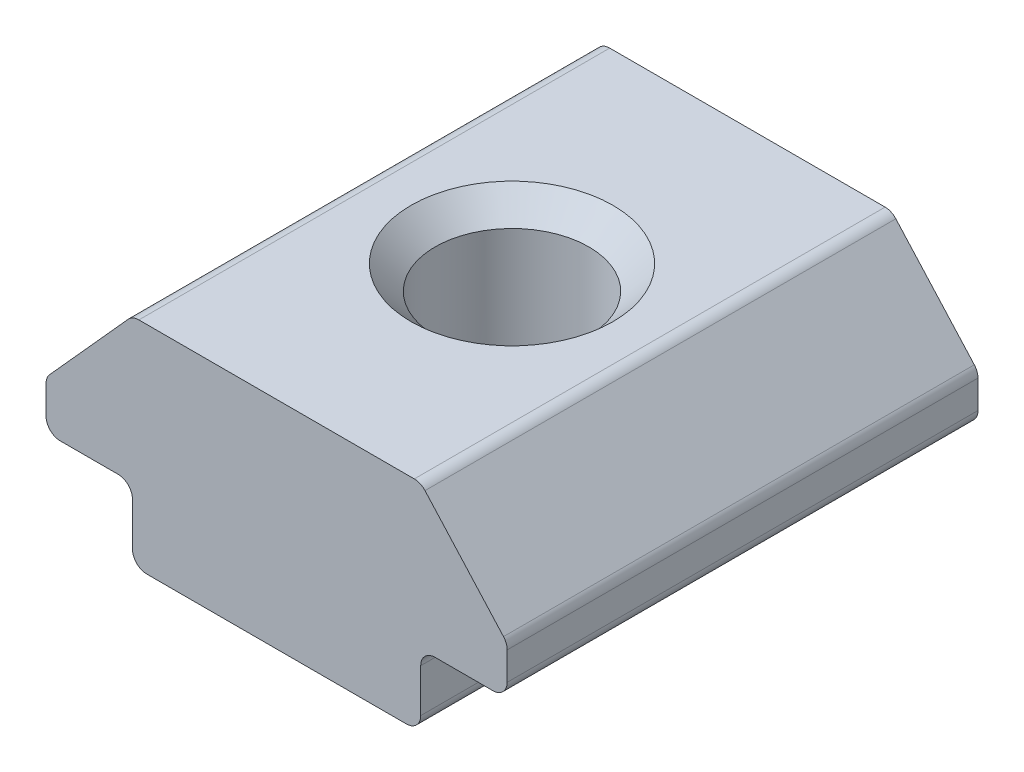
ISO-10303-21;
HEADER;
FILE_DESCRIPTION(('STEP AP214'),'2;1');
FILE_NAME('part.step','',(''),(''),'','','');
FILE_SCHEMA(('AUTOMOTIVE_DESIGN { 1 0 10303 214 1 1 1 1 }'));
ENDSEC;
DATA;
#1=APPLICATION_CONTEXT('core data for automotive mechanical design processes');
#2=APPLICATION_PROTOCOL_DEFINITION('international standard','automotive_design',2000,#1);
#3=PRODUCT_CONTEXT('',#1,'mechanical');
#4=PRODUCT('Part','Part','',(#3));
#5=PRODUCT_RELATED_PRODUCT_CATEGORY('part','',(#4));
#6=PRODUCT_DEFINITION_FORMATION('','',#4);
#7=PRODUCT_DEFINITION_CONTEXT('part definition',#1,'design');
#8=PRODUCT_DEFINITION('design','',#6,#7);
#9=PRODUCT_DEFINITION_SHAPE('','',#8);
#10=(LENGTH_UNIT() NAMED_UNIT(*) SI_UNIT(.MILLI.,.METRE.));
#11=(NAMED_UNIT(*) PLANE_ANGLE_UNIT() SI_UNIT($,.RADIAN.));
#12=(NAMED_UNIT(*) SI_UNIT($,.STERADIAN.) SOLID_ANGLE_UNIT());
#13=UNCERTAINTY_MEASURE_WITH_UNIT(LENGTH_MEASURE(1.E-05),#10,'distance_accuracy_value','');
#14=(GEOMETRIC_REPRESENTATION_CONTEXT(3) GLOBAL_UNCERTAINTY_ASSIGNED_CONTEXT((#13)) GLOBAL_UNIT_ASSIGNED_CONTEXT((#10,
#11,#12)) REPRESENTATION_CONTEXT('',''));
#15=CARTESIAN_POINT('',(0.,0.,0.));
#16=DIRECTION('',(0.,0.,1.));
#17=DIRECTION('',(1.,0.,0.));
#18=AXIS2_PLACEMENT_3D('',#15,#16,#17);
#19=CARTESIAN_POINT('',(-4.56181460766902,2.17462627726309,3.53766362557271));
#20=DIRECTION('',(1.,0.,0.));
#21=DIRECTION('',(0.,0.,-1.));
#22=AXIS2_PLACEMENT_3D('',#19,#20,#21);
#23=PLANE('',#22);
#24=DIRECTION('',(0.,-1.,0.));
#25=VECTOR('',#24,1.);
#26=CARTESIAN_POINT('',(-4.56181460766902,2.17462627726309,-6.26233637442729));
#27=LINE('',#26,#25);
#28=CARTESIAN_POINT('',(-4.56181460766902,1.87462627726309,-6.26233637442729));
#29=VERTEX_POINT('',#28);
#30=CARTESIAN_POINT('',(-4.56181460766902,0.974626277263088,-6.26233637442729));
#31=VERTEX_POINT('',#30);
#32=EDGE_CURVE('E302',#29,#31,#27,.T.);
#33=ORIENTED_EDGE('',*,*,#32,.T.);
#34=DIRECTION('',(0.,0.,-1.));
#35=VECTOR('',#34,1.);
#36=CARTESIAN_POINT('',(-4.56181460766902,0.974626277263088,3.53766362557271));
#37=LINE('',#36,#35);
#38=CARTESIAN_POINT('',(-4.56181460766902,0.974626277263088,3.53766362557271));
#39=VERTEX_POINT('',#38);
#40=EDGE_CURVE('E39',#31,#39,#37,.F.);
#41=ORIENTED_EDGE('',*,*,#40,.T.);
#42=DIRECTION('',(0.,-1.,0.));
#43=VECTOR('',#42,1.);
#44=CARTESIAN_POINT('',(-4.56181460766902,2.17462627726309,3.53766362557271));
#45=LINE('',#44,#43);
#46=CARTESIAN_POINT('',(-4.56181460766902,1.87462627726309,3.53766362557271));
#47=VERTEX_POINT('',#46);
#48=EDGE_CURVE('E183',#47,#39,#45,.T.);
#49=ORIENTED_EDGE('',*,*,#48,.F.);
#50=DIRECTION('',(0.,0.,-1.));
#51=VECTOR('',#50,1.);
#52=CARTESIAN_POINT('',(-4.56181460766902,1.87462627726309,-6.26233637442729));
#53=LINE('',#52,#51);
#54=EDGE_CURVE('E257',#47,#29,#53,.T.);
#55=ORIENTED_EDGE('',*,*,#54,.T.);
#56=EDGE_LOOP('',(#33,#41,#49,#55));
#57=FACE_BOUND('',#56,.T.);
#58=ADVANCED_FACE('F16',(#57),#23,.F.);
#59=CARTESIAN_POINT('',(-4.56181460766902,0.674626277263088,3.53766362557271));
#60=DIRECTION('',(0.,1.,0.));
#61=DIRECTION('',(0.,0.,1.));
#62=AXIS2_PLACEMENT_3D('',#59,#60,#61);
#63=PLANE('',#62);
#64=CARTESIAN_POINT('',(-1.56181460766902,0.674626277263088,-1.36233637442729));
#65=DIRECTION('',(0.,1.,0.));
#66=DIRECTION('',(0.,0.,1.));
#67=AXIS2_PLACEMENT_3D('',#64,#65,#66);
#68=CIRCLE('',#67,2.1);
#69=CARTESIAN_POINT('',(-1.56181460766902,0.674626277263088,0.737663625572716));
#70=VERTEX_POINT('',#69);
#71=EDGE_CURVE('E272',#70,#70,#68,.T.);
#72=ORIENTED_EDGE('',*,*,#71,.T.);
#73=EDGE_LOOP('',(#72));
#74=FACE_BOUND('',#73,.T.);
#75=DIRECTION('',(1.,0.,0.));
#76=VECTOR('',#75,1.);
#77=CARTESIAN_POINT('',(-4.56181460766902,0.674626277263088,-6.26233637442729));
#78=LINE('',#77,#76);
#79=CARTESIAN_POINT('',(-4.26181460766902,0.674626277263088,-6.26233637442729));
#80=VERTEX_POINT('',#79);
#81=CARTESIAN_POINT('',(1.13818539233098,0.674626277263088,-6.26233637442729));
#82=VERTEX_POINT('',#81);
#83=EDGE_CURVE('E296',#80,#82,#78,.T.);
#84=ORIENTED_EDGE('',*,*,#83,.T.);
#85=DIRECTION('',(0.,0.,-1.));
#86=VECTOR('',#85,1.);
#87=CARTESIAN_POINT('',(1.13818539233098,0.674626277263088,3.53766362557271));
#88=LINE('',#87,#86);
#89=CARTESIAN_POINT('',(1.13818539233098,0.674626277263088,3.53766362557271));
#90=VERTEX_POINT('',#89);
#91=EDGE_CURVE('E251',#82,#90,#88,.F.);
#92=ORIENTED_EDGE('',*,*,#91,.T.);
#93=DIRECTION('',(1.,0.,0.));
#94=VECTOR('',#93,1.);
#95=CARTESIAN_POINT('',(-4.56181460766902,0.674626277263088,3.53766362557271));
#96=LINE('',#95,#94);
#97=CARTESIAN_POINT('',(-4.26181460766902,0.674626277263088,3.53766362557271));
#98=VERTEX_POINT('',#97);
#99=EDGE_CURVE('E186',#98,#90,#96,.T.);
#100=ORIENTED_EDGE('',*,*,#99,.F.);
#101=DIRECTION('',(0.,0.,-1.));
#102=VECTOR('',#101,1.);
#103=CARTESIAN_POINT('',(-4.26181460766902,0.674626277263088,3.53766362557271));
#104=LINE('',#103,#102);
#105=EDGE_CURVE('E248',#98,#80,#104,.T.);
#106=ORIENTED_EDGE('',*,*,#105,.T.);
#107=EDGE_LOOP('',(#84,#92,#100,#106));
#108=FACE_BOUND('',#107,.T.);
#109=ADVANCED_FACE('F289',(#74,#108),#63,.F.);
#110=CARTESIAN_POINT('',(1.43818539233098,0.674626277263088,3.53766362557271));
#111=DIRECTION('',(-1.,0.,0.));
#112=DIRECTION('',(0.,0.,1.));
#113=AXIS2_PLACEMENT_3D('',#110,#111,#112);
#114=PLANE('',#113);
#115=DIRECTION('',(0.,1.,0.));
#116=VECTOR('',#115,1.);
#117=CARTESIAN_POINT('',(1.43818539233098,0.674626277263088,3.53766362557271));
#118=LINE('',#117,#116);
#119=CARTESIAN_POINT('',(1.43818539233098,0.974626277263088,3.53766362557271));
#120=VERTEX_POINT('',#119);
#121=CARTESIAN_POINT('',(1.43818539233098,1.87462627726309,3.53766362557271));
#122=VERTEX_POINT('',#121);
#123=EDGE_CURVE('E310',#120,#122,#118,.T.);
#124=ORIENTED_EDGE('',*,*,#123,.F.);
#125=DIRECTION('',(0.,0.,-1.));
#126=VECTOR('',#125,1.);
#127=CARTESIAN_POINT('',(1.43818539233098,0.974626277263088,3.53766362557271));
#128=LINE('',#127,#126);
#129=CARTESIAN_POINT('',(1.43818539233098,0.974626277263088,-6.26233637442729));
#130=VERTEX_POINT('',#129);
#131=EDGE_CURVE('E241',#120,#130,#128,.T.);
#132=ORIENTED_EDGE('',*,*,#131,.T.);
#133=DIRECTION('',(0.,1.,0.));
#134=VECTOR('',#133,1.);
#135=CARTESIAN_POINT('',(1.43818539233098,0.674626277263088,-6.26233637442729));
#136=LINE('',#135,#134);
#137=CARTESIAN_POINT('',(1.43818539233098,1.87462627726309,-6.26233637442729));
#138=VERTEX_POINT('',#137);
#139=EDGE_CURVE('E301',#130,#138,#136,.T.);
#140=ORIENTED_EDGE('',*,*,#139,.T.);
#141=DIRECTION('',(0.,0.,-1.));
#142=VECTOR('',#141,1.);
#143=CARTESIAN_POINT('',(1.43818539233098,1.87462627726309,3.53766362557271));
#144=LINE('',#143,#142);
#145=EDGE_CURVE('E239',#138,#122,#144,.F.);
#146=ORIENTED_EDGE('',*,*,#145,.T.);
#147=EDGE_LOOP('',(#124,#132,#140,#146));
#148=FACE_BOUND('',#147,.T.);
#149=ADVANCED_FACE('F292',(#148),#114,.F.);
#150=CARTESIAN_POINT('',(1.43818539233098,2.17462627726309,3.53766362557271));
#151=DIRECTION('',(0.,1.,0.));
#152=DIRECTION('',(0.,0.,1.));
#153=AXIS2_PLACEMENT_3D('',#150,#151,#152);
#154=PLANE('',#153);
#155=DIRECTION('',(1.,0.,0.));
#156=VECTOR('',#155,1.);
#157=CARTESIAN_POINT('',(1.43818539233098,2.17462627726309,3.53766362557271));
#158=LINE('',#157,#156);
#159=CARTESIAN_POINT('',(1.73818539233098,2.17462627726309,3.53766362557271));
#160=VERTEX_POINT('',#159);
#161=CARTESIAN_POINT('',(2.93818539233098,2.17462627726309,3.53766362557271));
#162=VERTEX_POINT('',#161);
#163=EDGE_CURVE('E314',#160,#162,#158,.T.);
#164=ORIENTED_EDGE('',*,*,#163,.F.);
#165=DIRECTION('',(0.,0.,-1.));
#166=VECTOR('',#165,1.);
#167=CARTESIAN_POINT('',(1.73818539233098,2.17462627726309,-6.26233637442729));
#168=LINE('',#167,#166);
#169=CARTESIAN_POINT('',(1.73818539233098,2.17462627726309,-6.26233637442729));
#170=VERTEX_POINT('',#169);
#171=EDGE_CURVE('E261',#160,#170,#168,.T.);
#172=ORIENTED_EDGE('',*,*,#171,.T.);
#173=DIRECTION('',(1.,0.,0.));
#174=VECTOR('',#173,1.);
#175=CARTESIAN_POINT('',(1.43818539233098,2.17462627726309,-6.26233637442729));
#176=LINE('',#175,#174);
#177=CARTESIAN_POINT('',(2.93818539233098,2.17462627726309,-6.26233637442729));
#178=VERTEX_POINT('',#177);
#179=EDGE_CURVE('E337',#170,#178,#176,.T.);
#180=ORIENTED_EDGE('',*,*,#179,.T.);
#181=DIRECTION('',(0.,0.,-1.));
#182=VECTOR('',#181,1.);
#183=CARTESIAN_POINT('',(2.93818539233098,2.17462627726309,3.53766362557271));
#184=LINE('',#183,#182);
#185=EDGE_CURVE('E236',#178,#162,#184,.F.);
#186=ORIENTED_EDGE('',*,*,#185,.T.);
#187=EDGE_LOOP('',(#164,#172,#180,#186));
#188=FACE_BOUND('',#187,.T.);
#189=ADVANCED_FACE('F545',(#188),#154,.F.);
#190=CARTESIAN_POINT('',(3.23818539233098,2.17462627726309,3.53766362557271));
#191=DIRECTION('',(-1.,0.,0.));
#192=DIRECTION('',(0.,0.,1.));
#193=AXIS2_PLACEMENT_3D('',#190,#191,#192);
#194=PLANE('',#193);
#195=DIRECTION('',(0.,1.,0.));
#196=VECTOR('',#195,1.);
#197=CARTESIAN_POINT('',(3.23818539233098,2.17462627726309,-6.26233637442729));
#198=LINE('',#197,#196);
#199=CARTESIAN_POINT('',(3.23818539233098,2.47462627726309,-6.26233637442729));
#200=VERTEX_POINT('',#199);
#201=CARTESIAN_POINT('',(3.23818539233098,3.05950547569396,-6.26233637442729));
#202=VERTEX_POINT('',#201);
#203=EDGE_CURVE('E339',#200,#202,#198,.T.);
#204=ORIENTED_EDGE('',*,*,#203,.T.);
#205=DIRECTION('',(0.,0.,-1.));
#206=VECTOR('',#205,1.);
#207=CARTESIAN_POINT('',(3.23818539233098,3.05950547569396,3.53766362557271));
#208=LINE('',#207,#206);
#209=CARTESIAN_POINT('',(3.23818539233098,3.05950547569396,3.53766362557271));
#210=VERTEX_POINT('',#209);
#211=EDGE_CURVE('E234',#202,#210,#208,.F.);
#212=ORIENTED_EDGE('',*,*,#211,.T.);
#213=DIRECTION('',(0.,1.,0.));
#214=VECTOR('',#213,1.);
#215=CARTESIAN_POINT('',(3.23818539233098,2.17462627726309,3.53766362557271));
#216=LINE('',#215,#214);
#217=CARTESIAN_POINT('',(3.23818539233098,2.47462627726309,3.53766362557271));
#218=VERTEX_POINT('',#217);
#219=EDGE_CURVE('E316',#218,#210,#216,.T.);
#220=ORIENTED_EDGE('',*,*,#219,.F.);
#221=DIRECTION('',(0.,0.,-1.));
#222=VECTOR('',#221,1.);
#223=CARTESIAN_POINT('',(3.23818539233098,2.47462627726309,3.53766362557271));
#224=LINE('',#223,#222);
#225=EDGE_CURVE('E231',#218,#200,#224,.T.);
#226=ORIENTED_EDGE('',*,*,#225,.T.);
#227=EDGE_LOOP('',(#204,#212,#220,#226));
#228=FACE_BOUND('',#227,.T.);
#229=ADVANCED_FACE('F536',(#228),#194,.F.);
#230=CARTESIAN_POINT('',(3.23818539233098,3.17462627726309,3.53766362557271));
#231=DIRECTION('',(-0.743294146247166,-0.66896473162245,0.));
#232=DIRECTION('',(0.66896473162245,-0.743294146247166,0.));
#233=AXIS2_PLACEMENT_3D('',#230,#231,#232);
#234=PLANE('',#233);
#235=DIRECTION('',(-0.66896473162245,0.743294146247166,0.));
#236=VECTOR('',#235,1.);
#237=CARTESIAN_POINT('',(3.23818539233098,3.17462627726309,-6.26233637442729));
#238=LINE('',#237,#236);
#239=CARTESIAN_POINT('',(3.16117363620513,3.2601948951807,-6.26233637442729));
#240=VERTEX_POINT('',#239);
#241=CARTESIAN_POINT('',(1.52756491479292,5.07531569674982,-6.26233637442729));
#242=VERTEX_POINT('',#241);
#243=EDGE_CURVE('E342',#240,#242,#238,.T.);
#244=ORIENTED_EDGE('',*,*,#243,.T.);
#245=DIRECTION('',(0.,0.,-1.));
#246=VECTOR('',#245,1.);
#247=CARTESIAN_POINT('',(1.52756491479292,5.07531569674982,3.53766362557271));
#248=LINE('',#247,#246);
#249=CARTESIAN_POINT('',(1.52756491479292,5.07531569674982,3.53766362557271));
#250=VERTEX_POINT('',#249);
#251=EDGE_CURVE('E229',#242,#250,#248,.F.);
#252=ORIENTED_EDGE('',*,*,#251,.T.);
#253=DIRECTION('',(-0.66896473162245,0.743294146247166,0.));
#254=VECTOR('',#253,1.);
#255=CARTESIAN_POINT('',(3.23818539233098,3.17462627726309,3.53766362557271));
#256=LINE('',#255,#254);
#257=CARTESIAN_POINT('',(3.16117363620513,3.2601948951807,3.53766362557271));
#258=VERTEX_POINT('',#257);
#259=EDGE_CURVE('E322',#258,#250,#256,.T.);
#260=ORIENTED_EDGE('',*,*,#259,.F.);
#261=DIRECTION('',(0.,0.,-1.));
#262=VECTOR('',#261,1.);
#263=CARTESIAN_POINT('',(3.16117363620513,3.2601948951807,3.53766362557271));
#264=LINE('',#263,#262);
#265=EDGE_CURVE('E226',#258,#240,#264,.T.);
#266=ORIENTED_EDGE('',*,*,#265,.T.);
#267=EDGE_LOOP('',(#244,#252,#260,#266));
#268=FACE_BOUND('',#267,.T.);
#269=ADVANCED_FACE('F527',(#268),#234,.F.);
#270=CARTESIAN_POINT('',(1.43818539233098,5.17462627726309,3.53766362557271));
#271=DIRECTION('',(0.,-1.,0.));
#272=DIRECTION('',(0.,0.,-1.));
#273=AXIS2_PLACEMENT_3D('',#270,#271,#272);
#274=PLANE('',#273);
#275=CARTESIAN_POINT('',(-1.56181460766902,5.17462627726309,-1.36233637442729));
#276=DIRECTION('',(0.,-1.,0.));
#277=DIRECTION('',(0.,0.,-1.));
#278=AXIS2_PLACEMENT_3D('',#275,#276,#277);
#279=CIRCLE('',#278,2.10000000000001);
#280=CARTESIAN_POINT('',(-1.56181460766902,5.17462627726309,-3.46233637442729));
#281=VERTEX_POINT('',#280);
#282=EDGE_CURVE('E10',#281,#281,#279,.T.);
#283=ORIENTED_EDGE('',*,*,#282,.T.);
#284=EDGE_LOOP('',(#283));
#285=FACE_BOUND('',#284,.T.);
#286=DIRECTION('',(-1.,0.,0.));
#287=VECTOR('',#286,1.);
#288=CARTESIAN_POINT('',(1.43818539233098,5.17462627726309,-6.26233637442729));
#289=LINE('',#288,#287);
#290=CARTESIAN_POINT('',(1.30457667091877,5.17462627726309,-6.26233637442729));
#291=VERTEX_POINT('',#290);
#292=CARTESIAN_POINT('',(-4.42820588625681,5.17462627726309,-6.26233637442729));
#293=VERTEX_POINT('',#292);
#294=EDGE_CURVE('E345',#291,#293,#289,.T.);
#295=ORIENTED_EDGE('',*,*,#294,.T.);
#296=DIRECTION('',(0.,0.,-1.));
#297=VECTOR('',#296,1.);
#298=CARTESIAN_POINT('',(-4.42820588625681,5.17462627726309,3.53766362557271));
#299=LINE('',#298,#297);
#300=CARTESIAN_POINT('',(-4.42820588625681,5.17462627726309,3.53766362557271));
#301=VERTEX_POINT('',#300);
#302=EDGE_CURVE('E224',#293,#301,#299,.F.);
#303=ORIENTED_EDGE('',*,*,#302,.T.);
#304=DIRECTION('',(-1.,0.,0.));
#305=VECTOR('',#304,1.);
#306=CARTESIAN_POINT('',(1.43818539233098,5.17462627726309,3.53766362557271));
#307=LINE('',#306,#305);
#308=CARTESIAN_POINT('',(1.30457667091877,5.17462627726309,3.53766362557271));
#309=VERTEX_POINT('',#308);
#310=EDGE_CURVE('E325',#309,#301,#307,.T.);
#311=ORIENTED_EDGE('',*,*,#310,.F.);
#312=DIRECTION('',(0.,0.,-1.));
#313=VECTOR('',#312,1.);
#314=CARTESIAN_POINT('',(1.30457667091877,5.17462627726309,3.53766362557271));
#315=LINE('',#314,#313);
#316=EDGE_CURVE('E221',#309,#291,#315,.T.);
#317=ORIENTED_EDGE('',*,*,#316,.T.);
#318=EDGE_LOOP('',(#295,#303,#311,#317));
#319=FACE_BOUND('',#318,.T.);
#320=ADVANCED_FACE('F369',(#285,#319),#274,.F.);
#321=CARTESIAN_POINT('',(-6.36181460766902,3.17462627726309,3.53766362557271));
#322=DIRECTION('',(0.743294146247166,-0.66896473162245,0.));
#323=DIRECTION('',(0.66896473162245,0.743294146247166,0.));
#324=AXIS2_PLACEMENT_3D('',#321,#322,#323);
#325=PLANE('',#324);
#326=DIRECTION('',(-0.66896473162245,-0.743294146247166,0.));
#327=VECTOR('',#326,1.);
#328=CARTESIAN_POINT('',(-6.36181460766902,3.17462627726309,-6.26233637442729));
#329=LINE('',#328,#327);
#330=CARTESIAN_POINT('',(-4.65119413013096,5.07531569674982,-6.26233637442729));
#331=VERTEX_POINT('',#330);
#332=CARTESIAN_POINT('',(-6.28480285154317,3.2601948951807,-6.26233637442729));
#333=VERTEX_POINT('',#332);
#334=EDGE_CURVE('E188',#331,#333,#329,.T.);
#335=ORIENTED_EDGE('',*,*,#334,.T.);
#336=DIRECTION('',(0.,0.,-1.));
#337=VECTOR('',#336,1.);
#338=CARTESIAN_POINT('',(-6.28480285154317,3.2601948951807,3.53766362557271));
#339=LINE('',#338,#337);
#340=CARTESIAN_POINT('',(-6.28480285154317,3.2601948951807,3.53766362557271));
#341=VERTEX_POINT('',#340);
#342=EDGE_CURVE('E219',#333,#341,#339,.F.);
#343=ORIENTED_EDGE('',*,*,#342,.T.);
#344=DIRECTION('',(-0.66896473162245,-0.743294146247166,0.));
#345=VECTOR('',#344,1.);
#346=CARTESIAN_POINT('',(-6.36181460766902,3.17462627726309,3.53766362557271));
#347=LINE('',#346,#345);
#348=CARTESIAN_POINT('',(-4.65119413013096,5.07531569674982,3.53766362557271));
#349=VERTEX_POINT('',#348);
#350=EDGE_CURVE('E328',#349,#341,#347,.T.);
#351=ORIENTED_EDGE('',*,*,#350,.F.);
#352=DIRECTION('',(0.,0.,-1.));
#353=VECTOR('',#352,1.);
#354=CARTESIAN_POINT('',(-4.65119413013096,5.07531569674982,3.53766362557271));
#355=LINE('',#354,#353);
#356=EDGE_CURVE('E216',#349,#331,#355,.T.);
#357=ORIENTED_EDGE('',*,*,#356,.T.);
#358=EDGE_LOOP('',(#335,#343,#351,#357));
#359=FACE_BOUND('',#358,.T.);
#360=ADVANCED_FACE('F351',(#359),#325,.F.);
#361=CARTESIAN_POINT('',(-6.36181460766902,2.17462627726309,3.53766362557271));
#362=DIRECTION('',(1.,0.,0.));
#363=DIRECTION('',(0.,0.,-1.));
#364=AXIS2_PLACEMENT_3D('',#361,#362,#363);
#365=PLANE('',#364);
#366=DIRECTION('',(0.,-1.,0.));
#367=VECTOR('',#366,1.);
#368=CARTESIAN_POINT('',(-6.36181460766902,2.17462627726309,-6.26233637442729));
#369=LINE('',#368,#367);
#370=CARTESIAN_POINT('',(-6.36181460766902,3.05950547569396,-6.26233637442729));
#371=VERTEX_POINT('',#370);
#372=CARTESIAN_POINT('',(-6.36181460766902,2.47462627726309,-6.26233637442729));
#373=VERTEX_POINT('',#372);
#374=EDGE_CURVE('E184',#371,#373,#369,.T.);
#375=ORIENTED_EDGE('',*,*,#374,.T.);
#376=DIRECTION('',(0.,0.,-1.));
#377=VECTOR('',#376,1.);
#378=CARTESIAN_POINT('',(-6.36181460766902,2.47462627726309,3.53766362557271));
#379=LINE('',#378,#377);
#380=CARTESIAN_POINT('',(-6.36181460766902,2.47462627726309,3.53766362557271));
#381=VERTEX_POINT('',#380);
#382=EDGE_CURVE('E161',#373,#381,#379,.F.);
#383=ORIENTED_EDGE('',*,*,#382,.T.);
#384=DIRECTION('',(0.,-1.,0.));
#385=VECTOR('',#384,1.);
#386=CARTESIAN_POINT('',(-6.36181460766902,2.17462627726309,3.53766362557271));
#387=LINE('',#386,#385);
#388=CARTESIAN_POINT('',(-6.36181460766902,3.05950547569396,3.53766362557271));
#389=VERTEX_POINT('',#388);
#390=EDGE_CURVE('E331',#389,#381,#387,.T.);
#391=ORIENTED_EDGE('',*,*,#390,.F.);
#392=DIRECTION('',(0.,0.,-1.));
#393=VECTOR('',#392,1.);
#394=CARTESIAN_POINT('',(-6.36181460766902,3.05950547569396,3.53766362557271));
#395=LINE('',#394,#393);
#396=EDGE_CURVE('E166',#389,#371,#395,.T.);
#397=ORIENTED_EDGE('',*,*,#396,.T.);
#398=EDGE_LOOP('',(#375,#383,#391,#397));
#399=FACE_BOUND('',#398,.T.);
#400=ADVANCED_FACE('F360',(#399),#365,.F.);
#401=CARTESIAN_POINT('',(-6.36181460766902,2.17462627726309,3.53766362557271));
#402=DIRECTION('',(0.,1.,0.));
#403=DIRECTION('',(0.,0.,1.));
#404=AXIS2_PLACEMENT_3D('',#401,#402,#403);
#405=PLANE('',#404);
#406=DIRECTION('',(1.,0.,0.));
#407=VECTOR('',#406,1.);
#408=CARTESIAN_POINT('',(-6.36181460766902,2.17462627726309,-6.26233637442729));
#409=LINE('',#408,#407);
#410=CARTESIAN_POINT('',(-6.06181460766902,2.17462627726309,-6.26233637442729));
#411=VERTEX_POINT('',#410);
#412=CARTESIAN_POINT('',(-4.86181460766902,2.17462627726309,-6.26233637442729));
#413=VERTEX_POINT('',#412);
#414=EDGE_CURVE('E173',#411,#413,#409,.T.);
#415=ORIENTED_EDGE('',*,*,#414,.T.);
#416=DIRECTION('',(0.,0.,-1.));
#417=VECTOR('',#416,1.);
#418=CARTESIAN_POINT('',(-4.86181460766902,2.17462627726309,3.53766362557271));
#419=LINE('',#418,#417);
#420=CARTESIAN_POINT('',(-4.86181460766902,2.17462627726309,3.53766362557271));
#421=VERTEX_POINT('',#420);
#422=EDGE_CURVE('E264',#413,#421,#419,.F.);
#423=ORIENTED_EDGE('',*,*,#422,.T.);
#424=DIRECTION('',(1.,0.,0.));
#425=VECTOR('',#424,1.);
#426=CARTESIAN_POINT('',(-6.36181460766902,2.17462627726309,3.53766362557271));
#427=LINE('',#426,#425);
#428=CARTESIAN_POINT('',(-6.06181460766902,2.17462627726309,3.53766362557271));
#429=VERTEX_POINT('',#428);
#430=EDGE_CURVE('E176',#429,#421,#427,.T.);
#431=ORIENTED_EDGE('',*,*,#430,.F.);
#432=DIRECTION('',(0.,0.,-1.));
#433=VECTOR('',#432,1.);
#434=CARTESIAN_POINT('',(-6.06181460766902,2.17462627726309,3.53766362557271));
#435=LINE('',#434,#433);
#436=EDGE_CURVE('E160',#429,#411,#435,.T.);
#437=ORIENTED_EDGE('',*,*,#436,.T.);
#438=EDGE_LOOP('',(#415,#423,#431,#437));
#439=FACE_BOUND('',#438,.T.);
#440=ADVANCED_FACE('F172',(#439),#405,.F.);
#441=CARTESIAN_POINT('',(-1.56181460766902,0.674626277263088,3.53766362557271));
#442=DIRECTION('',(0.,0.,1.));
#443=DIRECTION('',(1.,0.,0.));
#444=AXIS2_PLACEMENT_3D('',#441,#442,#443);
#445=PLANE('',#444);
#446=ORIENTED_EDGE('',*,*,#99,.T.);
#447=CARTESIAN_POINT('',(1.13818539233098,0.974626277263088,3.53766362557271));
#448=DIRECTION('',(0.,0.,1.));
#449=DIRECTION('',(1.,0.,0.));
#450=AXIS2_PLACEMENT_3D('',#447,#448,#449);
#451=CIRCLE('',#450,0.3);
#452=EDGE_CURVE('E255',#90,#120,#451,.T.);
#453=ORIENTED_EDGE('',*,*,#452,.T.);
#454=ORIENTED_EDGE('',*,*,#123,.T.);
#455=CARTESIAN_POINT('',(1.73818539233098,1.87462627726309,3.53766362557271));
#456=DIRECTION('',(0.,0.,1.));
#457=DIRECTION('',(1.,0.,0.));
#458=AXIS2_PLACEMENT_3D('',#455,#456,#457);
#459=CIRCLE('',#458,0.3);
#460=EDGE_CURVE('E31',#122,#160,#459,.F.);
#461=ORIENTED_EDGE('',*,*,#460,.T.);
#462=ORIENTED_EDGE('',*,*,#163,.T.);
#463=CARTESIAN_POINT('',(2.93818539233098,2.47462627726309,3.53766362557271));
#464=DIRECTION('',(0.,0.,1.));
#465=DIRECTION('',(1.,0.,0.));
#466=AXIS2_PLACEMENT_3D('',#463,#464,#465);
#467=CIRCLE('',#466,0.3);
#468=EDGE_CURVE('E204',#162,#218,#467,.T.);
#469=ORIENTED_EDGE('',*,*,#468,.T.);
#470=ORIENTED_EDGE('',*,*,#219,.T.);
#471=CARTESIAN_POINT('',(2.93818539233098,3.05950547569396,3.53766362557271));
#472=DIRECTION('',(0.,0.,1.));
#473=DIRECTION('',(1.,0.,0.));
#474=AXIS2_PLACEMENT_3D('',#471,#472,#473);
#475=CIRCLE('',#474,0.3);
#476=EDGE_CURVE('E206',#210,#258,#475,.T.);
#477=ORIENTED_EDGE('',*,*,#476,.T.);
#478=ORIENTED_EDGE('',*,*,#259,.T.);
#479=CARTESIAN_POINT('',(1.30457667091877,4.87462627726309,3.53766362557271));
#480=DIRECTION('',(0.,0.,1.));
#481=DIRECTION('',(1.,0.,0.));
#482=AXIS2_PLACEMENT_3D('',#479,#480,#481);
#483=CIRCLE('',#482,0.3);
#484=EDGE_CURVE('E208',#250,#309,#483,.T.);
#485=ORIENTED_EDGE('',*,*,#484,.T.);
#486=ORIENTED_EDGE('',*,*,#310,.T.);
#487=CARTESIAN_POINT('',(-4.42820588625681,4.87462627726309,3.53766362557271));
#488=DIRECTION('',(0.,0.,1.));
#489=DIRECTION('',(1.,0.,0.));
#490=AXIS2_PLACEMENT_3D('',#487,#488,#489);
#491=CIRCLE('',#490,0.3);
#492=EDGE_CURVE('E210',#301,#349,#491,.T.);
#493=ORIENTED_EDGE('',*,*,#492,.T.);
#494=ORIENTED_EDGE('',*,*,#350,.T.);
#495=CARTESIAN_POINT('',(-6.06181460766902,3.05950547569396,3.53766362557271));
#496=DIRECTION('',(0.,0.,1.));
#497=DIRECTION('',(1.,0.,0.));
#498=AXIS2_PLACEMENT_3D('',#495,#496,#497);
#499=CIRCLE('',#498,0.3);
#500=EDGE_CURVE('E212',#341,#389,#499,.T.);
#501=ORIENTED_EDGE('',*,*,#500,.T.);
#502=ORIENTED_EDGE('',*,*,#390,.T.);
#503=CARTESIAN_POINT('',(-6.06181460766902,2.47462627726309,3.53766362557271));
#504=DIRECTION('',(0.,0.,1.));
#505=DIRECTION('',(1.,0.,0.));
#506=AXIS2_PLACEMENT_3D('',#503,#504,#505);
#507=CIRCLE('',#506,0.3);
#508=EDGE_CURVE('E214',#381,#429,#507,.T.);
#509=ORIENTED_EDGE('',*,*,#508,.T.);
#510=ORIENTED_EDGE('',*,*,#430,.T.);
#511=CARTESIAN_POINT('',(-4.86181460766902,1.87462627726309,3.53766362557271));
#512=DIRECTION('',(0.,0.,1.));
#513=DIRECTION('',(1.,0.,0.));
#514=AXIS2_PLACEMENT_3D('',#511,#512,#513);
#515=CIRCLE('',#514,0.3);
#516=EDGE_CURVE('E270',#421,#47,#515,.F.);
#517=ORIENTED_EDGE('',*,*,#516,.T.);
#518=ORIENTED_EDGE('',*,*,#48,.T.);
#519=CARTESIAN_POINT('',(-4.26181460766902,0.974626277263088,3.53766362557271));
#520=DIRECTION('',(0.,0.,1.));
#521=DIRECTION('',(1.,0.,0.));
#522=AXIS2_PLACEMENT_3D('',#519,#520,#521);
#523=CIRCLE('',#522,0.3);
#524=EDGE_CURVE('E253',#39,#98,#523,.T.);
#525=ORIENTED_EDGE('',*,*,#524,.T.);
#526=EDGE_LOOP('',(#446,#453,#454,#461,#462,#469,#470,#477,#478,#485,#486,#493,#494,#501,#502,
#509,#510,#517,#518,#525));
#527=FACE_BOUND('',#526,.T.);
#528=ADVANCED_FACE('F309',(#527),#445,.T.);
#529=CARTESIAN_POINT('',(-1.56181460766902,0.674626277263088,-6.26233637442729));
#530=DIRECTION('',(0.,0.,1.));
#531=DIRECTION('',(1.,0.,0.));
#532=AXIS2_PLACEMENT_3D('',#529,#530,#531);
#533=PLANE('',#532);
#534=ORIENTED_EDGE('',*,*,#139,.F.);
#535=CARTESIAN_POINT('',(1.13818539233098,0.974626277263088,-6.26233637442729));
#536=DIRECTION('',(0.,0.,1.));
#537=DIRECTION('',(1.,0.,0.));
#538=AXIS2_PLACEMENT_3D('',#535,#536,#537);
#539=CIRCLE('',#538,0.3);
#540=EDGE_CURVE('E246',#130,#82,#539,.F.);
#541=ORIENTED_EDGE('',*,*,#540,.T.);
#542=ORIENTED_EDGE('',*,*,#83,.F.);
#543=CARTESIAN_POINT('',(-4.26181460766902,0.974626277263088,-6.26233637442729));
#544=DIRECTION('',(0.,0.,1.));
#545=DIRECTION('',(1.,0.,0.));
#546=AXIS2_PLACEMENT_3D('',#543,#544,#545);
#547=CIRCLE('',#546,0.3);
#548=EDGE_CURVE('E244',#80,#31,#547,.F.);
#549=ORIENTED_EDGE('',*,*,#548,.T.);
#550=ORIENTED_EDGE('',*,*,#32,.F.);
#551=CARTESIAN_POINT('',(-4.86181460766902,1.87462627726309,-6.26233637442729));
#552=DIRECTION('',(0.,0.,1.));
#553=DIRECTION('',(1.,0.,0.));
#554=AXIS2_PLACEMENT_3D('',#551,#552,#553);
#555=CIRCLE('',#554,0.3);
#556=EDGE_CURVE('E182',#29,#413,#555,.T.);
#557=ORIENTED_EDGE('',*,*,#556,.T.);
#558=ORIENTED_EDGE('',*,*,#414,.F.);
#559=CARTESIAN_POINT('',(-6.06181460766902,2.47462627726309,-6.26233637442729));
#560=DIRECTION('',(0.,0.,1.));
#561=DIRECTION('',(1.,0.,0.));
#562=AXIS2_PLACEMENT_3D('',#559,#560,#561);
#563=CIRCLE('',#562,0.3);
#564=EDGE_CURVE('E156',#411,#373,#563,.F.);
#565=ORIENTED_EDGE('',*,*,#564,.T.);
#566=ORIENTED_EDGE('',*,*,#374,.F.);
#567=CARTESIAN_POINT('',(-6.06181460766902,3.05950547569396,-6.26233637442729));
#568=DIRECTION('',(0.,0.,1.));
#569=DIRECTION('',(1.,0.,0.));
#570=AXIS2_PLACEMENT_3D('',#567,#568,#569);
#571=CIRCLE('',#570,0.3);
#572=EDGE_CURVE('E167',#371,#333,#571,.F.);
#573=ORIENTED_EDGE('',*,*,#572,.T.);
#574=ORIENTED_EDGE('',*,*,#334,.F.);
#575=CARTESIAN_POINT('',(-4.42820588625681,4.87462627726309,-6.26233637442729));
#576=DIRECTION('',(0.,0.,1.));
#577=DIRECTION('',(1.,0.,0.));
#578=AXIS2_PLACEMENT_3D('',#575,#576,#577);
#579=CIRCLE('',#578,0.3);
#580=EDGE_CURVE('E198',#331,#293,#579,.F.);
#581=ORIENTED_EDGE('',*,*,#580,.T.);
#582=ORIENTED_EDGE('',*,*,#294,.F.);
#583=CARTESIAN_POINT('',(1.30457667091877,4.87462627726309,-6.26233637442729));
#584=DIRECTION('',(0.,0.,1.));
#585=DIRECTION('',(1.,0.,0.));
#586=AXIS2_PLACEMENT_3D('',#583,#584,#585);
#587=CIRCLE('',#586,0.3);
#588=EDGE_CURVE('E196',#291,#242,#587,.F.);
#589=ORIENTED_EDGE('',*,*,#588,.T.);
#590=ORIENTED_EDGE('',*,*,#243,.F.);
#591=CARTESIAN_POINT('',(2.93818539233098,3.05950547569396,-6.26233637442729));
#592=DIRECTION('',(0.,0.,1.));
#593=DIRECTION('',(1.,0.,0.));
#594=AXIS2_PLACEMENT_3D('',#591,#592,#593);
#595=CIRCLE('',#594,0.3);
#596=EDGE_CURVE('E194',#240,#202,#595,.F.);
#597=ORIENTED_EDGE('',*,*,#596,.T.);
#598=ORIENTED_EDGE('',*,*,#203,.F.);
#599=CARTESIAN_POINT('',(2.93818539233098,2.47462627726309,-6.26233637442729));
#600=DIRECTION('',(0.,0.,1.));
#601=DIRECTION('',(1.,0.,0.));
#602=AXIS2_PLACEMENT_3D('',#599,#600,#601);
#603=CIRCLE('',#602,0.3);
#604=EDGE_CURVE('E177',#200,#178,#603,.F.);
#605=ORIENTED_EDGE('',*,*,#604,.T.);
#606=ORIENTED_EDGE('',*,*,#179,.F.);
#607=CARTESIAN_POINT('',(1.73818539233098,1.87462627726309,-6.26233637442729));
#608=DIRECTION('',(0.,0.,1.));
#609=DIRECTION('',(1.,0.,0.));
#610=AXIS2_PLACEMENT_3D('',#607,#608,#609);
#611=CIRCLE('',#610,0.3);
#612=EDGE_CURVE('E266',#170,#138,#611,.T.);
#613=ORIENTED_EDGE('',*,*,#612,.T.);
#614=EDGE_LOOP('',(#534,#541,#542,#549,#550,#557,#558,#565,#566,#573,#574,#581,#582,#589,#590,
#597,#598,#605,#606,#613));
#615=FACE_BOUND('',#614,.T.);
#616=ADVANCED_FACE('F180',(#615),#533,.F.);
#617=CARTESIAN_POINT('',(-6.06181460766902,2.47462627726309,3.53766362557271));
#618=DIRECTION('',(0.,0.,-1.));
#619=DIRECTION('',(-1.,0.,0.));
#620=AXIS2_PLACEMENT_3D('',#617,#618,#619);
#621=CYLINDRICAL_SURFACE('',#620,0.3);
#622=ORIENTED_EDGE('',*,*,#508,.F.);
#623=ORIENTED_EDGE('',*,*,#382,.F.);
#624=ORIENTED_EDGE('',*,*,#564,.F.);
#625=ORIENTED_EDGE('',*,*,#436,.F.);
#626=EDGE_LOOP('',(#622,#623,#624,#625));
#627=FACE_BOUND('',#626,.T.);
#628=ADVANCED_FACE('F159',(#627),#621,.T.);
#629=CARTESIAN_POINT('',(-6.06181460766902,3.05950547569396,3.53766362557271));
#630=DIRECTION('',(0.,0.,-1.));
#631=DIRECTION('',(-1.,0.,0.));
#632=AXIS2_PLACEMENT_3D('',#629,#630,#631);
#633=CYLINDRICAL_SURFACE('',#632,0.3);
#634=ORIENTED_EDGE('',*,*,#500,.F.);
#635=ORIENTED_EDGE('',*,*,#342,.F.);
#636=ORIENTED_EDGE('',*,*,#572,.F.);
#637=ORIENTED_EDGE('',*,*,#396,.F.);
#638=EDGE_LOOP('',(#634,#635,#636,#637));
#639=FACE_BOUND('',#638,.T.);
#640=ADVANCED_FACE('F356',(#639),#633,.T.);
#641=CARTESIAN_POINT('',(-4.42820588625681,4.87462627726309,3.53766362557271));
#642=DIRECTION('',(0.,0.,-1.));
#643=DIRECTION('',(-1.,0.,0.));
#644=AXIS2_PLACEMENT_3D('',#641,#642,#643);
#645=CYLINDRICAL_SURFACE('',#644,0.3);
#646=ORIENTED_EDGE('',*,*,#492,.F.);
#647=ORIENTED_EDGE('',*,*,#302,.F.);
#648=ORIENTED_EDGE('',*,*,#580,.F.);
#649=ORIENTED_EDGE('',*,*,#356,.F.);
#650=EDGE_LOOP('',(#646,#647,#648,#649));
#651=FACE_BOUND('',#650,.T.);
#652=ADVANCED_FACE('F381',(#651),#645,.T.);
#653=CARTESIAN_POINT('',(1.30457667091877,4.87462627726309,3.53766362557271));
#654=DIRECTION('',(0.,0.,-1.));
#655=DIRECTION('',(-1.,0.,0.));
#656=AXIS2_PLACEMENT_3D('',#653,#654,#655);
#657=CYLINDRICAL_SURFACE('',#656,0.3);
#658=ORIENTED_EDGE('',*,*,#484,.F.);
#659=ORIENTED_EDGE('',*,*,#251,.F.);
#660=ORIENTED_EDGE('',*,*,#588,.F.);
#661=ORIENTED_EDGE('',*,*,#316,.F.);
#662=EDGE_LOOP('',(#658,#659,#660,#661));
#663=FACE_BOUND('',#662,.T.);
#664=ADVANCED_FACE('F384',(#663),#657,.T.);
#665=CARTESIAN_POINT('',(2.93818539233098,3.05950547569396,3.53766362557271));
#666=DIRECTION('',(0.,0.,-1.));
#667=DIRECTION('',(-1.,0.,0.));
#668=AXIS2_PLACEMENT_3D('',#665,#666,#667);
#669=CYLINDRICAL_SURFACE('',#668,0.3);
#670=ORIENTED_EDGE('',*,*,#476,.F.);
#671=ORIENTED_EDGE('',*,*,#211,.F.);
#672=ORIENTED_EDGE('',*,*,#596,.F.);
#673=ORIENTED_EDGE('',*,*,#265,.F.);
#674=EDGE_LOOP('',(#670,#671,#672,#673));
#675=FACE_BOUND('',#674,.T.);
#676=ADVANCED_FACE('F388',(#675),#669,.T.);
#677=CARTESIAN_POINT('',(2.93818539233098,2.47462627726309,3.53766362557271));
#678=DIRECTION('',(0.,0.,-1.));
#679=DIRECTION('',(-1.,0.,0.));
#680=AXIS2_PLACEMENT_3D('',#677,#678,#679);
#681=CYLINDRICAL_SURFACE('',#680,0.3);
#682=ORIENTED_EDGE('',*,*,#468,.F.);
#683=ORIENTED_EDGE('',*,*,#185,.F.);
#684=ORIENTED_EDGE('',*,*,#604,.F.);
#685=ORIENTED_EDGE('',*,*,#225,.F.);
#686=EDGE_LOOP('',(#682,#683,#684,#685));
#687=FACE_BOUND('',#686,.T.);
#688=ADVANCED_FACE('F392',(#687),#681,.T.);
#689=CARTESIAN_POINT('',(-1.56181460766902,0.674626277263088,-1.36233637442729));
#690=DIRECTION('',(0.,1.,0.));
#691=DIRECTION('',(0.,0.,1.));
#692=AXIS2_PLACEMENT_3D('',#689,#690,#691);
#693=CYLINDRICAL_SURFACE('',#692,1.6);
#694=CARTESIAN_POINT('',(-1.56181460766902,1.17462627726309,-1.36233637442729));
#695=DIRECTION('',(0.,1.,0.));
#696=DIRECTION('',(0.,0.,1.));
#697=AXIS2_PLACEMENT_3D('',#694,#695,#696);
#698=CIRCLE('',#697,1.6);
#699=CARTESIAN_POINT('',(-1.56181460766902,1.17462627726309,0.237663625572714));
#700=VERTEX_POINT('',#699);
#701=EDGE_CURVE('E24',#700,#700,#698,.F.);
#702=ORIENTED_EDGE('',*,*,#701,.T.);
#703=EDGE_LOOP('',(#702));
#704=FACE_BOUND('',#703,.T.);
#705=CARTESIAN_POINT('',(-1.56181460766902,4.67462627726308,-1.36233637442729));
#706=DIRECTION('',(0.,-1.,0.));
#707=DIRECTION('',(0.,0.,-1.));
#708=AXIS2_PLACEMENT_3D('',#705,#706,#707);
#709=CIRCLE('',#708,1.6);
#710=CARTESIAN_POINT('',(-1.56181460766902,4.67462627726308,-2.96233637442729));
#711=VERTEX_POINT('',#710);
#712=EDGE_CURVE('E275',#711,#711,#709,.F.);
#713=ORIENTED_EDGE('',*,*,#712,.T.);
#714=EDGE_LOOP('',(#713));
#715=FACE_BOUND('',#714,.T.);
#716=ADVANCED_FACE('F280',(#704,#715),#693,.F.);
#717=CARTESIAN_POINT('',(1.13818539233098,0.974626277263088,3.53766362557271));
#718=DIRECTION('',(0.,0.,-1.));
#719=DIRECTION('',(-1.,0.,0.));
#720=AXIS2_PLACEMENT_3D('',#717,#718,#719);
#721=CYLINDRICAL_SURFACE('',#720,0.3);
#722=ORIENTED_EDGE('',*,*,#452,.F.);
#723=ORIENTED_EDGE('',*,*,#91,.F.);
#724=ORIENTED_EDGE('',*,*,#540,.F.);
#725=ORIENTED_EDGE('',*,*,#131,.F.);
#726=EDGE_LOOP('',(#722,#723,#724,#725));
#727=FACE_BOUND('',#726,.T.);
#728=ADVANCED_FACE('F306',(#727),#721,.T.);
#729=CARTESIAN_POINT('',(-4.26181460766902,0.974626277263088,3.53766362557271));
#730=DIRECTION('',(0.,0.,-1.));
#731=DIRECTION('',(-1.,0.,0.));
#732=AXIS2_PLACEMENT_3D('',#729,#730,#731);
#733=CYLINDRICAL_SURFACE('',#732,0.3);
#734=ORIENTED_EDGE('',*,*,#524,.F.);
#735=ORIENTED_EDGE('',*,*,#40,.F.);
#736=ORIENTED_EDGE('',*,*,#548,.F.);
#737=ORIENTED_EDGE('',*,*,#105,.F.);
#738=EDGE_LOOP('',(#734,#735,#736,#737));
#739=FACE_BOUND('',#738,.T.);
#740=ADVANCED_FACE('F399',(#739),#733,.T.);
#741=CARTESIAN_POINT('',(1.73818539233098,1.87462627726309,3.53766362557271));
#742=DIRECTION('',(0.,0.,1.));
#743=DIRECTION('',(1.,0.,0.));
#744=AXIS2_PLACEMENT_3D('',#741,#742,#743);
#745=CYLINDRICAL_SURFACE('',#744,0.3);
#746=ORIENTED_EDGE('',*,*,#460,.F.);
#747=ORIENTED_EDGE('',*,*,#145,.F.);
#748=ORIENTED_EDGE('',*,*,#612,.F.);
#749=ORIENTED_EDGE('',*,*,#171,.F.);
#750=EDGE_LOOP('',(#746,#747,#748,#749));
#751=FACE_BOUND('',#750,.T.);
#752=ADVANCED_FACE('F402',(#751),#745,.F.);
#753=CARTESIAN_POINT('',(-4.86181460766902,1.87462627726309,3.53766362557271));
#754=DIRECTION('',(0.,0.,1.));
#755=DIRECTION('',(1.,0.,0.));
#756=AXIS2_PLACEMENT_3D('',#753,#754,#755);
#757=CYLINDRICAL_SURFACE('',#756,0.3);
#758=ORIENTED_EDGE('',*,*,#516,.F.);
#759=ORIENTED_EDGE('',*,*,#422,.F.);
#760=ORIENTED_EDGE('',*,*,#556,.F.);
#761=ORIENTED_EDGE('',*,*,#54,.F.);
#762=EDGE_LOOP('',(#758,#759,#760,#761));
#763=FACE_BOUND('',#762,.T.);
#764=ADVANCED_FACE('F286',(#763),#757,.F.);
#765=CARTESIAN_POINT('',(-1.56181460766902,0.674626277263088,-1.36233637442729));
#766=DIRECTION('',(0.,-1.,0.));
#767=DIRECTION('',(0.,0.,-1.));
#768=AXIS2_PLACEMENT_3D('',#765,#766,#767);
#769=CONICAL_SURFACE('',#768,2.1,0.785398163397445);
#770=ORIENTED_EDGE('',*,*,#701,.F.);
#771=EDGE_LOOP('',(#770));
#772=FACE_BOUND('',#771,.T.);
#773=ORIENTED_EDGE('',*,*,#71,.F.);
#774=EDGE_LOOP('',(#773));
#775=FACE_BOUND('',#774,.T.);
#776=ADVANCED_FACE('F283',(#772,#775),#769,.F.);
#777=CARTESIAN_POINT('',(-1.56181460766902,4.67462627726308,-1.36233637442729));
#778=DIRECTION('',(0.,1.,0.));
#779=DIRECTION('',(0.,0.,1.));
#780=AXIS2_PLACEMENT_3D('',#777,#778,#779);
#781=CONICAL_SURFACE('',#780,1.6,0.78539816339745);
#782=ORIENTED_EDGE('',*,*,#282,.F.);
#783=EDGE_LOOP('',(#782));
#784=FACE_BOUND('',#783,.T.);
#785=ORIENTED_EDGE('',*,*,#712,.F.);
#786=EDGE_LOOP('',(#785));
#787=FACE_BOUND('',#786,.T.);
#788=ADVANCED_FACE('F18',(#784,#787),#781,.F.);
#789=CLOSED_SHELL('',(#58,#109,#149,#189,#229,#269,#320,#360,#400,#440,#528,#616,#628,#640,#652,
#664,#676,#688,#716,#728,#740,#752,#764,#776,#788));
#790=MANIFOLD_SOLID_BREP('B1',#789);
#791=ADVANCED_BREP_SHAPE_REPRESENTATION('',(#18,#790),#14);
#792=SHAPE_DEFINITION_REPRESENTATION(#9,#791);
ENDSEC;
END-ISO-10303-21;
